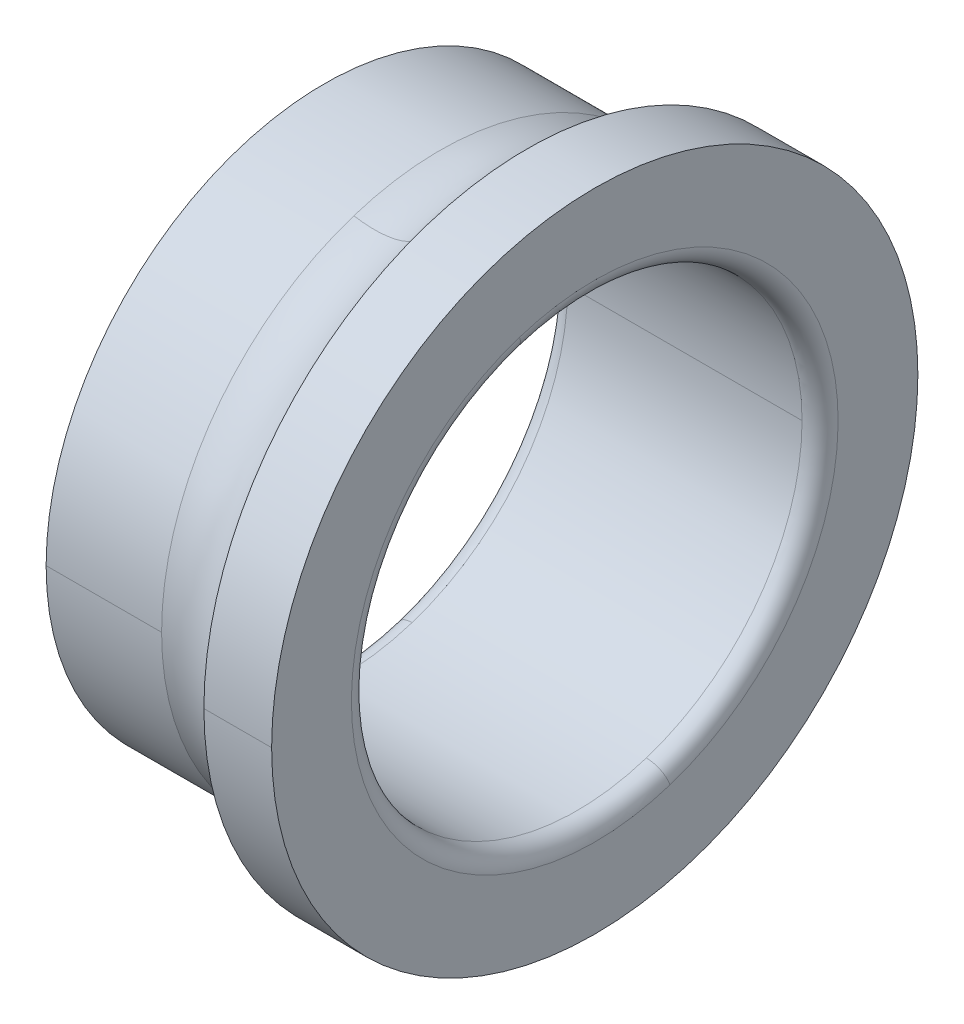
ISO-10303-21;
HEADER;
FILE_DESCRIPTION(('STEP AP214'),'2;1');
FILE_NAME('part.step','',(''),(''),'','','');
FILE_SCHEMA(('AUTOMOTIVE_DESIGN { 1 0 10303 214 1 1 1 1 }'));
ENDSEC;
DATA;
#1=APPLICATION_CONTEXT('core data for automotive mechanical design processes');
#2=APPLICATION_PROTOCOL_DEFINITION('international standard','automotive_design',2000,#1);
#3=PRODUCT_CONTEXT('',#1,'mechanical');
#4=PRODUCT('Part','Part','',(#3));
#5=PRODUCT_RELATED_PRODUCT_CATEGORY('part','',(#4));
#6=PRODUCT_DEFINITION_FORMATION('','',#4);
#7=PRODUCT_DEFINITION_CONTEXT('part definition',#1,'design');
#8=PRODUCT_DEFINITION('design','',#6,#7);
#9=PRODUCT_DEFINITION_SHAPE('','',#8);
#10=(LENGTH_UNIT() NAMED_UNIT(*) SI_UNIT(.MILLI.,.METRE.));
#11=(NAMED_UNIT(*) PLANE_ANGLE_UNIT() SI_UNIT($,.RADIAN.));
#12=(NAMED_UNIT(*) SI_UNIT($,.STERADIAN.) SOLID_ANGLE_UNIT());
#13=UNCERTAINTY_MEASURE_WITH_UNIT(LENGTH_MEASURE(1.E-05),#10,'distance_accuracy_value','');
#14=(GEOMETRIC_REPRESENTATION_CONTEXT(3) GLOBAL_UNCERTAINTY_ASSIGNED_CONTEXT((#13)) GLOBAL_UNIT_ASSIGNED_CONTEXT((#10,
#11,#12)) REPRESENTATION_CONTEXT('',''));
#15=CARTESIAN_POINT('',(0.,0.,0.));
#16=DIRECTION('',(0.,0.,1.));
#17=DIRECTION('',(1.,0.,0.));
#18=AXIS2_PLACEMENT_3D('',#15,#16,#17);
#19=CARTESIAN_POINT('',(15.,0.,0.));
#20=DIRECTION('',(1.,0.,0.));
#21=DIRECTION('',(0.,1.,0.));
#22=AXIS2_PLACEMENT_3D('',#19,#20,#21);
#23=CYLINDRICAL_SURFACE('',#22,15.435);
#24=DIRECTION('',(1.,0.,0.));
#25=VECTOR('',#24,1.);
#26=CARTESIAN_POINT('',(0.,0.,15.435));
#27=LINE('',#26,#25);
#28=CARTESIAN_POINT('',(0.,0.,15.435));
#29=VERTEX_POINT('',#28);
#30=CARTESIAN_POINT('',(6.405131971423,0.,15.435));
#31=VERTEX_POINT('',#30);
#32=EDGE_CURVE('E11',#29,#31,#27,.T.);
#33=ORIENTED_EDGE('',*,*,#32,.F.);
#34=CARTESIAN_POINT('',(0.,0.,0.));
#35=DIRECTION('',(1.,0.,0.));
#36=DIRECTION('',(0.,0.,-1.));
#37=AXIS2_PLACEMENT_3D('',#34,#35,#36);
#38=CIRCLE('',#37,15.435);
#39=CARTESIAN_POINT('',(0.,0.,-15.435));
#40=VERTEX_POINT('',#39);
#41=EDGE_CURVE('E25',#29,#40,#38,.T.);
#42=ORIENTED_EDGE('',*,*,#41,.T.);
#43=DIRECTION('',(1.,0.,0.));
#44=VECTOR('',#43,1.);
#45=CARTESIAN_POINT('',(0.,0.,-15.435));
#46=LINE('',#45,#44);
#47=CARTESIAN_POINT('',(6.405131971423,0.,-15.435));
#48=VERTEX_POINT('',#47);
#49=EDGE_CURVE('E326',#40,#48,#46,.T.);
#50=ORIENTED_EDGE('',*,*,#49,.T.);
#51=CARTESIAN_POINT('',(6.405131971423,0.,0.));
#52=DIRECTION('',(1.,0.,0.));
#53=DIRECTION('',(0.,0.,-1.));
#54=AXIS2_PLACEMENT_3D('',#51,#52,#53);
#55=CIRCLE('',#54,15.435);
#56=CARTESIAN_POINT('',(6.40513197142301,-14.6795573290157,-4.76967730817731));
#57=VERTEX_POINT('',#56);
#58=EDGE_CURVE('E321',#57,#48,#55,.T.);
#59=ORIENTED_EDGE('',*,*,#58,.F.);
#60=CARTESIAN_POINT('',(6.405131971423,0.,0.));
#61=DIRECTION('',(1.,0.,0.));
#62=DIRECTION('',(0.,0.,-1.));
#63=AXIS2_PLACEMENT_3D('',#60,#61,#62);
#64=CIRCLE('',#63,15.435);
#65=EDGE_CURVE('E316',#31,#57,#64,.T.);
#66=ORIENTED_EDGE('',*,*,#65,.F.);
#67=EDGE_LOOP('',(#33,#42,#50,#59,#66));
#68=FACE_BOUND('',#67,.T.);
#69=ADVANCED_FACE('F17',(#68),#23,.T.);
#70=CARTESIAN_POINT('',(7.50000000000026,0.,0.));
#71=DIRECTION('',(1.,0.,0.));
#72=DIRECTION('',(0.,0.309016994374947,-0.951056516295154));
#73=AXIS2_PLACEMENT_3D('',#70,#71,#72);
#74=TOROIDAL_SURFACE('',#73,19.2499999999994,3.9689999999995);
#75=CARTESIAN_POINT('',(7.50000000000026,-18.3078379386811,-5.94857714171755));
#76=DIRECTION('',(0.,0.309016994374947,-0.951056516295154));
#77=DIRECTION('',(-0.275854882483595,0.914154852523531,0.297026916991783));
#78=AXIS2_PLACEMENT_3D('',#75,#76,#77);
#79=CIRCLE('',#78,3.9689999999995);
#80=CARTESIAN_POINT('',(11.241301377863,-17.0476880545906,-5.53912962417093));
#81=VERTEX_POINT('',#80);
#82=EDGE_CURVE('E312',#57,#81,#79,.T.);
#83=ORIENTED_EDGE('',*,*,#82,.T.);
#84=CARTESIAN_POINT('',(11.241301377863,0.,0.));
#85=DIRECTION('',(1.,0.,0.));
#86=DIRECTION('',(0.,0.,-1.));
#87=AXIS2_PLACEMENT_3D('',#84,#85,#86);
#88=CIRCLE('',#87,17.925);
#89=CARTESIAN_POINT('',(11.241301377863,0.,17.925));
#90=VERTEX_POINT('',#89);
#91=EDGE_CURVE('E110',#90,#81,#88,.T.);
#92=ORIENTED_EDGE('',*,*,#91,.F.);
#93=CARTESIAN_POINT('',(11.241301377863,0.,0.));
#94=DIRECTION('',(1.,0.,0.));
#95=DIRECTION('',(0.,0.,-1.));
#96=AXIS2_PLACEMENT_3D('',#93,#94,#95);
#97=CIRCLE('',#96,17.925);
#98=CARTESIAN_POINT('',(11.241301377863,17.0476880545906,5.53912962417093));
#99=VERTEX_POINT('',#98);
#100=EDGE_CURVE('E305',#99,#90,#97,.T.);
#101=ORIENTED_EDGE('',*,*,#100,.F.);
#102=CARTESIAN_POINT('',(7.50000000000026,18.3078379386811,5.94857714171755));
#103=DIRECTION('',(0.,-0.309016994374947,0.951056516295154));
#104=DIRECTION('',(-0.275854882483596,-0.914154852523531,-0.297026916991783));
#105=AXIS2_PLACEMENT_3D('',#102,#103,#104);
#106=CIRCLE('',#105,3.9689999999995);
#107=CARTESIAN_POINT('',(6.40513197142301,14.6795573290157,4.76967730817731));
#108=VERTEX_POINT('',#107);
#109=EDGE_CURVE('E120',#108,#99,#106,.T.);
#110=ORIENTED_EDGE('',*,*,#109,.F.);
#111=CARTESIAN_POINT('',(6.405131971423,0.,0.));
#112=DIRECTION('',(1.,0.,0.));
#113=DIRECTION('',(0.,0.,-1.));
#114=AXIS2_PLACEMENT_3D('',#111,#112,#113);
#115=CIRCLE('',#114,15.435);
#116=EDGE_CURVE('E297',#108,#31,#115,.T.);
#117=ORIENTED_EDGE('',*,*,#116,.T.);
#118=ORIENTED_EDGE('',*,*,#65,.T.);
#119=EDGE_LOOP('',(#83,#92,#101,#110,#117,#118));
#120=FACE_BOUND('',#119,.T.);
#121=ADVANCED_FACE('F339',(#120),#74,.F.);
#122=CARTESIAN_POINT('',(15.,0.,0.));
#123=DIRECTION('',(1.,0.,0.));
#124=DIRECTION('',(0.,-1.,0.));
#125=AXIS2_PLACEMENT_3D('',#122,#123,#124);
#126=CYLINDRICAL_SURFACE('',#125,15.435);
#127=ORIENTED_EDGE('',*,*,#32,.T.);
#128=ORIENTED_EDGE('',*,*,#116,.F.);
#129=CARTESIAN_POINT('',(6.405131971423,0.,0.));
#130=DIRECTION('',(1.,0.,0.));
#131=DIRECTION('',(0.,0.,-1.));
#132=AXIS2_PLACEMENT_3D('',#129,#130,#131);
#133=CIRCLE('',#132,15.435);
#134=EDGE_CURVE('E293',#48,#108,#133,.T.);
#135=ORIENTED_EDGE('',*,*,#134,.F.);
#136=ORIENTED_EDGE('',*,*,#49,.F.);
#137=CARTESIAN_POINT('',(0.,0.,0.));
#138=DIRECTION('',(1.,0.,0.));
#139=DIRECTION('',(0.,0.,-1.));
#140=AXIS2_PLACEMENT_3D('',#137,#138,#139);
#141=CIRCLE('',#140,15.435);
#142=EDGE_CURVE('E289',#40,#29,#141,.T.);
#143=ORIENTED_EDGE('',*,*,#142,.T.);
#144=EDGE_LOOP('',(#127,#128,#135,#136,#143));
#145=FACE_BOUND('',#144,.T.);
#146=ADVANCED_FACE('F270',(#145),#126,.T.);
#147=CARTESIAN_POINT('',(0.,15.435,0.));
#148=DIRECTION('',(-1.,0.,0.));
#149=DIRECTION('',(0.,0.,1.));
#150=AXIS2_PLACEMENT_3D('',#147,#148,#149);
#151=PLANE('',#150);
#152=CARTESIAN_POINT('',(0.,0.,0.));
#153=DIRECTION('',(1.,0.,0.));
#154=DIRECTION('',(0.,0.,-1.));
#155=AXIS2_PLACEMENT_3D('',#152,#153,#154);
#156=CIRCLE('',#155,13.5);
#157=CARTESIAN_POINT('',(0.,12.8392629699838,4.17172942406155));
#158=VERTEX_POINT('',#157);
#159=CARTESIAN_POINT('',(0.,-12.8392629699838,-4.17172942406155));
#160=VERTEX_POINT('',#159);
#161=EDGE_CURVE('E287',#158,#160,#156,.T.);
#162=ORIENTED_EDGE('',*,*,#161,.T.);
#163=CARTESIAN_POINT('',(0.,-12.8392629699846,-4.17172942406179));
#164=CARTESIAN_POINT('',(0.,-12.1839426289104,-6.18849726476169));
#165=CARTESIAN_POINT('',(0.,-11.132793947267,-8.07671556446459));
#166=CARTESIAN_POINT('',(0.,-9.718783629147,-9.73221970907687));
#167=CARTESIAN_POINT('',(0.,-6.3178643906336,-12.3995022947433));
#168=CARTESIAN_POINT('',(0.,-2.16097457552139,-13.5831280076085));
#169=CARTESIAN_POINT('',(0.,0.00950126210939699,-13.7539518618789));
#170=CARTESIAN_POINT('',(0.,4.30036652574963,-13.2351672601192));
#171=CARTESIAN_POINT('',(0.,8.0766833826385,-11.132765497821));
#172=CARTESIAN_POINT('',(0.,9.73222747888206,-9.7187924088551));
#173=CARTESIAN_POINT('',(0.,12.3995042447957,-6.31786056344028));
#174=CARTESIAN_POINT('',(0.,13.5831163376985,-2.16097345019989));
#175=CARTESIAN_POINT('',(0.,13.7539937939669,0.00949194862997871));
#176=CARTESIAN_POINT('',(0.,13.4945240713571,2.15494233521602));
#177=CARTESIAN_POINT('',(0.,12.8392629699846,4.17172942406179));
#178=B_SPLINE_CURVE_WITH_KNOTS('',5,(#163,#164,#165,#166,#167,#168,#169,#170,#171,#172,#173,
#174,#175,#176,#177),.UNSPECIFIED.,.F.,.F.,(6,3,3,3,6),(0.,0.785398163397448,1.5707963267949,
2.35619449019234,3.14159265358979),.UNSPECIFIED.);
#179=EDGE_CURVE('E285',#160,#158,#178,.T.);
#180=ORIENTED_EDGE('',*,*,#179,.T.);
#181=EDGE_LOOP('',(#162,#180));
#182=FACE_BOUND('',#181,.T.);
#183=ORIENTED_EDGE('',*,*,#41,.F.);
#184=ORIENTED_EDGE('',*,*,#142,.F.);
#185=EDGE_LOOP('',(#183,#184));
#186=FACE_BOUND('',#185,.T.);
#187=ADVANCED_FACE('F264',(#182,#186),#151,.T.);
#188=CARTESIAN_POINT('',(0.99999999999922,0.,0.));
#189=DIRECTION('',(1.,0.,0.));
#190=DIRECTION('',(0.,-0.309016994374947,0.951056516295154));
#191=AXIS2_PLACEMENT_3D('',#188,#189,#190);
#192=TOROIDAL_SURFACE('',#191,13.4999999999992,0.99999999999922);
#193=CARTESIAN_POINT('',(0.99999999999922,-12.8392629699838,-4.17172942406155));
#194=DIRECTION('',(0.,0.309016994374947,-0.951056516295154));
#195=DIRECTION('',(-1.,0.,0.));
#196=AXIS2_PLACEMENT_3D('',#193,#194,#195);
#197=CIRCLE('',#196,0.99999999999922);
#198=CARTESIAN_POINT('',(1.,-11.8882064536894,-3.86271242968684));
#199=VERTEX_POINT('',#198);
#200=EDGE_CURVE('E494',#160,#199,#197,.T.);
#201=ORIENTED_EDGE('',*,*,#200,.T.);
#202=CARTESIAN_POINT('',(1.,0.,0.));
#203=DIRECTION('',(1.,0.,0.));
#204=DIRECTION('',(0.,0.,-1.));
#205=AXIS2_PLACEMENT_3D('',#202,#203,#204);
#206=CIRCLE('',#205,12.5);
#207=CARTESIAN_POINT('',(1.,0.,-12.5));
#208=VERTEX_POINT('',#207);
#209=EDGE_CURVE('E492',#199,#208,#206,.T.);
#210=ORIENTED_EDGE('',*,*,#209,.T.);
#211=CARTESIAN_POINT('',(1.,0.,0.));
#212=DIRECTION('',(1.,0.,0.));
#213=DIRECTION('',(0.,0.,-1.));
#214=AXIS2_PLACEMENT_3D('',#211,#212,#213);
#215=CIRCLE('',#214,12.5);
#216=CARTESIAN_POINT('',(1.,11.8882064536894,3.86271242968684));
#217=VERTEX_POINT('',#216);
#218=EDGE_CURVE('E490',#208,#217,#215,.T.);
#219=ORIENTED_EDGE('',*,*,#218,.T.);
#220=CARTESIAN_POINT('',(0.99999999999922,12.8392629699838,4.17172942406155));
#221=DIRECTION('',(0.,-0.309016994374947,0.951056516295154));
#222=DIRECTION('',(-1.,0.,0.));
#223=AXIS2_PLACEMENT_3D('',#220,#221,#222);
#224=CIRCLE('',#223,0.99999999999922);
#225=EDGE_CURVE('E244',#158,#217,#224,.T.);
#226=ORIENTED_EDGE('',*,*,#225,.F.);
#227=ORIENTED_EDGE('',*,*,#179,.F.);
#228=EDGE_LOOP('',(#201,#210,#219,#226,#227));
#229=FACE_BOUND('',#228,.T.);
#230=ADVANCED_FACE('F253',(#229),#192,.T.);
#231=CARTESIAN_POINT('',(0.99999999999922,0.,0.));
#232=DIRECTION('',(1.,0.,0.));
#233=DIRECTION('',(0.,0.309016994374947,-0.951056516295154));
#234=AXIS2_PLACEMENT_3D('',#231,#232,#233);
#235=TOROIDAL_SURFACE('',#234,13.4999999999992,0.99999999999922);
#236=ORIENTED_EDGE('',*,*,#200,.F.);
#237=ORIENTED_EDGE('',*,*,#161,.F.);
#238=ORIENTED_EDGE('',*,*,#225,.T.);
#239=CARTESIAN_POINT('',(1.,0.,0.));
#240=DIRECTION('',(1.,0.,0.));
#241=DIRECTION('',(0.,0.,-1.));
#242=AXIS2_PLACEMENT_3D('',#239,#240,#241);
#243=CIRCLE('',#242,12.5);
#244=CARTESIAN_POINT('',(1.,0.,12.5));
#245=VERTEX_POINT('',#244);
#246=EDGE_CURVE('E240',#217,#245,#243,.T.);
#247=ORIENTED_EDGE('',*,*,#246,.T.);
#248=CARTESIAN_POINT('',(1.,0.,0.));
#249=DIRECTION('',(1.,0.,0.));
#250=DIRECTION('',(0.,0.,-1.));
#251=AXIS2_PLACEMENT_3D('',#248,#249,#250);
#252=CIRCLE('',#251,12.5);
#253=EDGE_CURVE('E235',#245,#199,#252,.T.);
#254=ORIENTED_EDGE('',*,*,#253,.T.);
#255=EDGE_LOOP('',(#236,#237,#238,#247,#254));
#256=FACE_BOUND('',#255,.T.);
#257=ADVANCED_FACE('F263',(#256),#235,.T.);
#258=CARTESIAN_POINT('',(15.,0.,0.));
#259=DIRECTION('',(1.,0.,0.));
#260=DIRECTION('',(0.,1.,0.));
#261=AXIS2_PLACEMENT_3D('',#258,#259,#260);
#262=CYLINDRICAL_SURFACE('',#261,12.5);
#263=DIRECTION('',(1.,0.,0.));
#264=VECTOR('',#263,1.);
#265=CARTESIAN_POINT('',(1.,0.,12.5));
#266=LINE('',#265,#264);
#267=CARTESIAN_POINT('',(14.,0.,12.5));
#268=VERTEX_POINT('',#267);
#269=EDGE_CURVE('E231',#245,#268,#266,.T.);
#270=ORIENTED_EDGE('',*,*,#269,.T.);
#271=CARTESIAN_POINT('',(14.,0.,0.));
#272=DIRECTION('',(1.,0.,0.));
#273=DIRECTION('',(0.,0.,-1.));
#274=AXIS2_PLACEMENT_3D('',#271,#272,#273);
#275=CIRCLE('',#274,12.5);
#276=CARTESIAN_POINT('',(14.,-11.8882064536894,-3.86271242968684));
#277=VERTEX_POINT('',#276);
#278=EDGE_CURVE('E227',#268,#277,#275,.T.);
#279=ORIENTED_EDGE('',*,*,#278,.T.);
#280=CARTESIAN_POINT('',(14.,0.,0.));
#281=DIRECTION('',(1.,0.,0.));
#282=DIRECTION('',(0.,0.,-1.));
#283=AXIS2_PLACEMENT_3D('',#280,#281,#282);
#284=CIRCLE('',#283,12.5);
#285=CARTESIAN_POINT('',(14.,0.,-12.5));
#286=VERTEX_POINT('',#285);
#287=EDGE_CURVE('E223',#277,#286,#284,.T.);
#288=ORIENTED_EDGE('',*,*,#287,.T.);
#289=DIRECTION('',(1.,0.,0.));
#290=VECTOR('',#289,1.);
#291=CARTESIAN_POINT('',(1.,0.,-12.5));
#292=LINE('',#291,#290);
#293=EDGE_CURVE('E218',#208,#286,#292,.T.);
#294=ORIENTED_EDGE('',*,*,#293,.F.);
#295=ORIENTED_EDGE('',*,*,#209,.F.);
#296=ORIENTED_EDGE('',*,*,#253,.F.);
#297=EDGE_LOOP('',(#270,#279,#288,#294,#295,#296));
#298=FACE_BOUND('',#297,.T.);
#299=ADVANCED_FACE('F390',(#298),#262,.F.);
#300=CARTESIAN_POINT('',(15.,0.,0.));
#301=DIRECTION('',(1.,0.,0.));
#302=DIRECTION('',(0.,-1.,0.));
#303=AXIS2_PLACEMENT_3D('',#300,#301,#302);
#304=CYLINDRICAL_SURFACE('',#303,12.5);
#305=ORIENTED_EDGE('',*,*,#269,.F.);
#306=ORIENTED_EDGE('',*,*,#246,.F.);
#307=ORIENTED_EDGE('',*,*,#218,.F.);
#308=ORIENTED_EDGE('',*,*,#293,.T.);
#309=CARTESIAN_POINT('',(14.,0.,0.));
#310=DIRECTION('',(1.,0.,0.));
#311=DIRECTION('',(0.,0.,-1.));
#312=AXIS2_PLACEMENT_3D('',#309,#310,#311);
#313=CIRCLE('',#312,12.5);
#314=CARTESIAN_POINT('',(14.,11.8882064536894,3.86271242968684));
#315=VERTEX_POINT('',#314);
#316=EDGE_CURVE('E214',#286,#315,#313,.T.);
#317=ORIENTED_EDGE('',*,*,#316,.T.);
#318=CARTESIAN_POINT('',(14.,0.,0.));
#319=DIRECTION('',(1.,0.,0.));
#320=DIRECTION('',(0.,0.,-1.));
#321=AXIS2_PLACEMENT_3D('',#318,#319,#320);
#322=CIRCLE('',#321,12.5);
#323=EDGE_CURVE('E209',#315,#268,#322,.T.);
#324=ORIENTED_EDGE('',*,*,#323,.T.);
#325=EDGE_LOOP('',(#305,#306,#307,#308,#317,#324));
#326=FACE_BOUND('',#325,.T.);
#327=ADVANCED_FACE('F400',(#326),#304,.F.);
#328=CARTESIAN_POINT('',(14.0000000000015,0.,0.));
#329=DIRECTION('',(1.,0.,0.));
#330=DIRECTION('',(0.,0.309016994374947,-0.951056516295154));
#331=AXIS2_PLACEMENT_3D('',#328,#329,#330);
#332=TOROIDAL_SURFACE('',#331,13.4999999999984,0.99999999999845);
#333=CARTESIAN_POINT('',(14.0000000000015,-12.8392629699831,-4.17172942406131));
#334=DIRECTION('',(0.,0.309016994374947,-0.951056516295154));
#335=DIRECTION('',(-1.538325022923E-12,0.951056516295154,0.309016994374947));
#336=AXIS2_PLACEMENT_3D('',#333,#334,#335);
#337=CIRCLE('',#336,0.999999999998449);
#338=CARTESIAN_POINT('',(15.,-12.8392629699831,-4.17172942406131));
#339=VERTEX_POINT('',#338);
#340=EDGE_CURVE('E188',#277,#339,#337,.T.);
#341=ORIENTED_EDGE('',*,*,#340,.F.);
#342=ORIENTED_EDGE('',*,*,#278,.F.);
#343=ORIENTED_EDGE('',*,*,#323,.F.);
#344=CARTESIAN_POINT('',(14.0000000000015,12.8392629699831,4.17172942406131));
#345=DIRECTION('',(0.,-0.309016994374947,0.951056516295154));
#346=DIRECTION('',(-1.538325022923E-12,-0.951056516295154,-0.309016994374947));
#347=AXIS2_PLACEMENT_3D('',#344,#345,#346);
#348=CIRCLE('',#347,0.99999999999845);
#349=CARTESIAN_POINT('',(15.,12.8392629699831,4.17172942406131));
#350=VERTEX_POINT('',#349);
#351=EDGE_CURVE('E187',#315,#350,#348,.T.);
#352=ORIENTED_EDGE('',*,*,#351,.T.);
#353=CARTESIAN_POINT('',(15.,12.8392629699831,4.17172942406133));
#354=CARTESIAN_POINT('',(15.,12.7710075943356,4.38181303325399));
#355=CARTESIAN_POINT('',(15.,12.6975874010329,4.59021807223762));
#356=CARTESIAN_POINT('',(15.,12.5406135083281,5.00317626233255));
#357=CARTESIAN_POINT('',(15.,12.457059808926,5.20772941344384));
#358=CARTESIAN_POINT('',(15.,12.2800150332338,5.61248908033976));
#359=CARTESIAN_POINT('',(15.,12.1865239569436,5.81269559612439));
#360=CARTESIAN_POINT('',(15.,11.9898310380084,6.2082802027819));
#361=CARTESIAN_POINT('',(15.,11.8866291953634,6.40365829365477));
#362=CARTESIAN_POINT('',(15.,11.6707629955994,6.78911522676152));
#363=CARTESIAN_POINT('',(15.,11.5580986384805,6.97919406899541));
#364=CARTESIAN_POINT('',(15.,11.3235789273211,7.35359462596973));
#365=CARTESIAN_POINT('',(15.,11.2017235732806,7.53791634071017));
#366=CARTESIAN_POINT('',(15.,10.9491154019057,7.90035858543361));
#367=CARTESIAN_POINT('',(15.,10.8183625845713,8.07847911541663));
#368=CARTESIAN_POINT('',(15.,10.548274488724,8.42808988537554));
#369=CARTESIAN_POINT('',(15.,10.408939210211,8.59958012535145));
#370=CARTESIAN_POINT('',(15.,10.1220218609874,8.93551717956152));
#371=CARTESIAN_POINT('',(15.,9.97443979027678,9.09996399379568));
#372=CARTESIAN_POINT('',(15.,9.67138439530445,9.42141802993741));
#373=CARTESIAN_POINT('',(15.,9.51591107104275,9.57842525184497));
#374=CARTESIAN_POINT('',(15.,9.19744771768723,9.88462185913161));
#375=CARTESIAN_POINT('',(15.,9.03445768859339,10.0338112445107));
#376=CARTESIAN_POINT('',(15.,8.70135358286664,10.3240127684575));
#377=CARTESIAN_POINT('',(15.,8.53123950623373,10.4650249070252));
#378=CARTESIAN_POINT('',(15.,8.18429712512982,10.7385322267525));
#379=CARTESIAN_POINT('',(15.,8.00746882065883,10.8710274079121));
#380=CARTESIAN_POINT('',(15.,7.6475239787552,11.1271816203276));
#381=CARTESIAN_POINT('',(15.,7.46440744132256,11.2508406515835));
#382=CARTESIAN_POINT('',(15.,7.09232727727273,11.4890246587537));
#383=CARTESIAN_POINT('',(15.,6.90336365065554,11.603549634668));
#384=CARTESIAN_POINT('',(15.,6.52004453816456,11.823189630457));
#385=CARTESIAN_POINT('',(15.,6.32568905229077,11.9283046503317));
#386=CARTESIAN_POINT('',(15.,5.93205444067555,12.1288715027515));
#387=CARTESIAN_POINT('',(15.,5.73277531493413,12.2243233352966));
#388=CARTESIAN_POINT('',(15.,5.32977350445234,12.4053338612322));
#389=CARTESIAN_POINT('',(15.,5.12605081971199,12.4908925546226));
#390=CARTESIAN_POINT('',(15.,4.71465267702389,12.6519106838622));
#391=CARTESIAN_POINT('',(15.,4.50697721907614,12.7273701197115));
#392=CARTESIAN_POINT('',(15.,4.08817383834168,12.8680079454784));
#393=CARTESIAN_POINT('',(15.,3.87704591555496,12.933186335396));
#394=CARTESIAN_POINT('',(15.,3.45184623080117,13.0531050488495));
#395=CARTESIAN_POINT('',(15.,3.2377744688341,13.1078453723853));
#396=CARTESIAN_POINT('',(15.,2.80720282334464,13.2067560788409));
#397=CARTESIAN_POINT('',(15.,2.59070293982225,13.2509264617608));
#398=CARTESIAN_POINT('',(15.,2.15579661840474,13.3285908766632));
#399=CARTESIAN_POINT('',(15.,1.9373901805096,13.3620849086458));
#400=CARTESIAN_POINT('',(15.,1.49919691058562,13.418315931617));
#401=CARTESIAN_POINT('',(15.,1.27941007855677,13.4410529226055));
#402=CARTESIAN_POINT('',(15.,0.838985506094766,13.4757150881858));
#403=CARTESIAN_POINT('',(15.,0.618347765661609,13.4876402627775));
#404=CARTESIAN_POINT('',(15.,0.176752912033277,13.5006500667739));
#405=CARTESIAN_POINT('',(15.,-0.0442042011618989,13.5017346961787));
#406=CARTESIAN_POINT('',(15.,-0.485905495275026,13.4930607968339));
#407=CARTESIAN_POINT('',(15.,-0.706649676192978,13.4833022680845));
#408=CARTESIAN_POINT('',(15.,-1.14739331368492,13.4529655615818));
#409=CARTESIAN_POINT('',(15.,-1.36739277025891,13.4323873838287));
#410=CARTESIAN_POINT('',(15.,-1.80611696110236,13.3804609539512));
#411=CARTESIAN_POINT('',(15.,-2.02484169537182,13.349112701827));
#412=CARTESIAN_POINT('',(15.,-2.46048951456334,13.2757216438926));
#413=CARTESIAN_POINT('',(15.,-2.6774125994854,13.2336788380825));
#414=CARTESIAN_POINT('',(15.,-3.10893453327032,13.138999957578));
#415=CARTESIAN_POINT('',(15.,-3.32353338213318,13.0863638828837));
#416=CARTESIAN_POINT('',(15.,-3.74988985637614,12.9706252695251));
#417=CARTESIAN_POINT('',(15.,-3.96164748175624,12.9075227308609));
#418=CARTESIAN_POINT('',(15.,-4.38181136636639,12.7710032091053));
#419=CARTESIAN_POINT('',(15.,-4.59021762559642,12.697586226014));
#420=CARTESIAN_POINT('',(15.,-5.00317670897371,12.540614683347));
#421=CARTESIAN_POINT('',(15.,-5.20772953312097,12.4570601237714));
#422=CARTESIAN_POINT('',(15.,-5.6124889606626,12.2800147183884));
#423=CARTESIAN_POINT('',(15.,-5.81269556405698,12.1865238725811));
#424=CARTESIAN_POINT('',(15.,-6.20828023484927,11.989831122371));
#425=CARTESIAN_POINT('',(15.,-6.40365830224719,11.8866292179682));
#426=CARTESIAN_POINT('',(15.,-6.78911521816907,11.6707629729946));
#427=CARTESIAN_POINT('',(15.,-6.97919406669305,11.5580986324236));
#428=CARTESIAN_POINT('',(15.,-7.35359462827204,11.3235789333781));
#429=CARTESIAN_POINT('',(15.,-7.53791634132706,11.2017235749036));
#430=CARTESIAN_POINT('',(15.,-7.90035858481669,10.9491154002827));
#431=CARTESIAN_POINT('',(15.,-8.07847911525132,10.8183625841365));
#432=CARTESIAN_POINT('',(15.,-8.42808988554083,10.5482744891589));
#433=CARTESIAN_POINT('',(15.,-8.59958012539572,10.4089392103276));
#434=CARTESIAN_POINT('',(15.,-8.93551717951721,10.1220218608709));
#435=CARTESIAN_POINT('',(15.,-9.0999639937838,9.97443979024557));
#436=CARTESIAN_POINT('',(15.,-9.42141802994927,9.67138439533568));
#437=CARTESIAN_POINT('',(15.,-9.57842525184814,9.51591107105113));
#438=CARTESIAN_POINT('',(15.,-9.88462185912842,9.19744771767887));
#439=CARTESIAN_POINT('',(15.,-10.0338112445098,9.03445768859117));
#440=CARTESIAN_POINT('',(15.,-10.3240127684583,8.70135358286891));
#441=CARTESIAN_POINT('',(15.,-10.4650249070254,8.53123950623435));
#442=CARTESIAN_POINT('',(15.,-10.7385322267523,8.18429712512925));
#443=CARTESIAN_POINT('',(15.,-10.871027407912,8.00746882065869));
#444=CARTESIAN_POINT('',(15.,-11.1271816203276,7.64752397875538));
#445=CARTESIAN_POINT('',(15.,-11.2508406515835,7.46440744132263));
#446=CARTESIAN_POINT('',(15.,-11.4890246587536,7.09232727727271));
#447=CARTESIAN_POINT('',(15.,-11.603549634668,6.90336365065554));
#448=CARTESIAN_POINT('',(15.,-11.823189630457,6.52004453816458));
#449=CARTESIAN_POINT('',(15.,-11.9283046503317,6.32568905229078));
#450=CARTESIAN_POINT('',(15.,-12.1288715027515,5.93205444067556));
#451=CARTESIAN_POINT('',(15.,-12.2243233352966,5.73277531493414));
#452=CARTESIAN_POINT('',(15.,-12.4053338612322,5.32977350445236));
#453=CARTESIAN_POINT('',(15.,-12.4908925546226,5.126050819712));
#454=CARTESIAN_POINT('',(15.,-12.6519106838622,4.71465267702392));
#455=CARTESIAN_POINT('',(15.,-12.7273701197113,4.50697721907621));
#456=CARTESIAN_POINT('',(15.,-12.8680079454785,4.08817383834166));
#457=CARTESIAN_POINT('',(15.,-12.9331863353966,3.87704591555481));
#458=CARTESIAN_POINT('',(15.,-13.0531050488488,3.45184623080135));
#459=CARTESIAN_POINT('',(15.,-13.1078453723829,3.23777446883474));
#460=CARTESIAN_POINT('',(15.,-13.2067560788432,2.80720282334403));
#461=CARTESIAN_POINT('',(15.,-13.2509264617694,2.59070293981993));
#462=CARTESIAN_POINT('',(15.,-13.3285908766546,2.1557966184071));
#463=CARTESIAN_POINT('',(15.,-13.3620849086136,1.93739018051838));
#464=CARTESIAN_POINT('',(15.,-13.4183159316492,1.49919691057689));
#465=CARTESIAN_POINT('',(15.,-13.4410529227258,1.27941007852414));
#466=CARTESIAN_POINT('',(15.,-13.4757150880655,0.838985506127448));
#467=CARTESIAN_POINT('',(15.,-13.4876402623285,0.618347765783513));
#468=CARTESIAN_POINT('',(15.,-13.5006500672229,0.176752911911422));
#469=CARTESIAN_POINT('',(15.,-13.5017346978543,-0.0442042016167351));
#470=CARTESIAN_POINT('',(15.,-13.4930607951583,-0.485905494820141));
#471=CARTESIAN_POINT('',(15.,-13.483302261831,-0.70664967449539));
#472=CARTESIAN_POINT('',(15.,-13.4529655678353,-1.14739331538246));
#473=CARTESIAN_POINT('',(15.,-13.4323874071669,-1.36739277659428));
#474=CARTESIAN_POINT('',(15.,-13.380460930613,-1.80611695476695));
#475=CARTESIAN_POINT('',(15.,-13.3491126147275,-2.0248416717278));
#476=CARTESIAN_POINT('',(15.,-13.2757217309921,-2.46048953820733));
#477=CARTESIAN_POINT('',(15.,-13.2336791631422,-2.67741268772601));
#478=CARTESIAN_POINT('',(15.,-13.1389996325183,-3.10893444502967));
#479=CARTESIAN_POINT('',(15.,-13.0863626697443,-3.32353305281467));
#480=CARTESIAN_POINT('',(15.,-12.9706264826645,-3.7498901856946));
#481=CARTESIAN_POINT('',(15.,-12.9075272583587,-3.96164871078955));
#482=CARTESIAN_POINT('',(15.,-12.8392629699831,-4.17172942406129));
#483=B_SPLINE_CURVE_WITH_KNOTS('',3,(#353,#354,#355,#356,#357,#358,#359,#360,#361,#362,#363,
#364,#365,#366,#367,#368,#369,#370,#371,#372,#373,#374,#375,#376,#377,#378,#379,#380,#381,#382,
#383,#384,#385,#386,#387,#388,#389,#390,#391,#392,#393,#394,#395,#396,#397,#398,#399,#400,#401,
#402,#403,#404,#405,#406,#407,#408,#409,#410,#411,#412,#413,#414,#415,#416,#417,#418,#419,#420,
#421,#422,#423,#424,#425,#426,#427,#428,#429,#430,#431,#432,#433,#434,#435,#436,#437,#438,#439,
#440,#441,#442,#443,#444,#445,#446,#447,#448,#449,#450,#451,#452,#453,#454,#455,#456,#457,#458,
#459,#460,#461,#462,#463,#464,#465,#466,#467,#468,#469,#470,#471,#472,#473,#474,#475,#476,#477,
#478,#479,#480,#481,#482),.UNSPECIFIED.,.F.,.F.,(4,2,2,2,2,2,2,2,2,2,2,2,2,2,2,2,2,2,2,2,2,2,2,
2,2,2,2,2,2,2,2,2,2,2,2,2,2,2,2,2,2,2,2,2,2,2,2,2,2,2,2,2,2,2,2,2,2,2,2,2,2,2,2,2,4),(0.,
0.662613170118552,1.32522634023711,1.98783951035566,2.65045268047422,3.31306585059277,
3.97567902071133,4.63829219082988,5.30090536094844,5.96351853106699,6.62613170118554,
7.2887448713041,7.95135804142266,8.61397121154121,9.27658438165976,9.93919755177832,
10.6018107218969,11.2644238920154,11.927037062134,12.5896502322525,13.2522634023711,
13.9148765724896,14.5774897426082,15.2401029127268,15.9027160828453,16.5653292529639,
17.2279424230824,17.890555593201,18.5531687633195,19.2157819334381,19.8783951035566,
20.5410082736752,21.2036214437937,21.8662346139123,22.5288477840309,23.1914609541494,
23.854074124268,24.5166872943865,25.1793004645051,25.8419136346236,26.5045268047422,
27.1671399748607,27.8297531449793,28.4923663150978,29.1549794852164,29.817592655335,
30.4802058254535,31.1428189955721,31.8054321656906,32.4680453358092,33.1306585059277,
33.7932716760463,34.4558848461648,35.1184980162834,35.7811111864019,36.4437243565205,
37.106337526639,37.7689506967576,38.4315638668761,39.0941770369947,39.7567902071133,
40.4194033772318,41.0820165473504,41.7446297174689,42.4072428875875),.UNSPECIFIED.);
#484=EDGE_CURVE('E182',#350,#339,#483,.T.);
#485=ORIENTED_EDGE('',*,*,#484,.T.);
#486=EDGE_LOOP('',(#341,#342,#343,#352,#485));
#487=FACE_BOUND('',#486,.T.);
#488=ADVANCED_FACE('F162',(#487),#332,.T.);
#489=CARTESIAN_POINT('',(15.,13.5,0.));
#490=DIRECTION('',(1.,0.,0.));
#491=DIRECTION('',(0.,0.,-1.));
#492=AXIS2_PLACEMENT_3D('',#489,#490,#491);
#493=PLANE('',#492);
#494=CARTESIAN_POINT('',(15.,0.,0.));
#495=DIRECTION('',(1.,0.,0.));
#496=DIRECTION('',(0.,0.,-1.));
#497=AXIS2_PLACEMENT_3D('',#494,#495,#496);
#498=CIRCLE('',#497,17.925);
#499=CARTESIAN_POINT('',(15.,0.,-17.925));
#500=VERTEX_POINT('',#499);
#501=CARTESIAN_POINT('',(15.,0.,17.925));
#502=VERTEX_POINT('',#501);
#503=EDGE_CURVE('E127',#500,#502,#498,.T.);
#504=ORIENTED_EDGE('',*,*,#503,.T.);
#505=CARTESIAN_POINT('',(15.,0.,0.));
#506=DIRECTION('',(1.,0.,0.));
#507=DIRECTION('',(0.,0.,-1.));
#508=AXIS2_PLACEMENT_3D('',#505,#506,#507);
#509=CIRCLE('',#508,17.925);
#510=EDGE_CURVE('E190',#502,#500,#509,.T.);
#511=ORIENTED_EDGE('',*,*,#510,.T.);
#512=EDGE_LOOP('',(#504,#511));
#513=FACE_BOUND('',#512,.T.);
#514=CARTESIAN_POINT('',(15.,-12.8392629699831,-4.17172942406133));
#515=CARTESIAN_POINT('',(15.,-12.7710075943356,-4.38181303325398));
#516=CARTESIAN_POINT('',(15.,-12.6975874010329,-4.59021807223762));
#517=CARTESIAN_POINT('',(15.,-12.5406135083281,-5.00317626233254));
#518=CARTESIAN_POINT('',(15.,-12.457059808926,-5.20772941344384));
#519=CARTESIAN_POINT('',(15.,-12.2800150332338,-5.61248908033976));
#520=CARTESIAN_POINT('',(15.,-12.1865239569436,-5.81269559612439));
#521=CARTESIAN_POINT('',(15.,-11.9898310380084,-6.2082802027819));
#522=CARTESIAN_POINT('',(15.,-11.8866291953634,-6.40365829365477));
#523=CARTESIAN_POINT('',(15.,-11.6707629955994,-6.78911522676152));
#524=CARTESIAN_POINT('',(15.,-11.5580986384805,-6.9791940689954));
#525=CARTESIAN_POINT('',(15.,-11.3235789273211,-7.35359462596972));
#526=CARTESIAN_POINT('',(15.,-11.2017235732806,-7.53791634071016));
#527=CARTESIAN_POINT('',(15.,-10.9491154019057,-7.90035858543361));
#528=CARTESIAN_POINT('',(15.,-10.8183625845713,-8.07847911541662));
#529=CARTESIAN_POINT('',(15.,-10.548274488724,-8.42808988537554));
#530=CARTESIAN_POINT('',(15.,-10.408939210211,-8.59958012535144));
#531=CARTESIAN_POINT('',(15.,-10.1220218609874,-8.93551717956151));
#532=CARTESIAN_POINT('',(15.,-9.97443979027678,-9.09996399379568));
#533=CARTESIAN_POINT('',(15.,-9.67138439530445,-9.4214180299374));
#534=CARTESIAN_POINT('',(15.,-9.51591107104276,-9.57842525184497));
#535=CARTESIAN_POINT('',(15.,-9.19744771768723,-9.8846218591316));
#536=CARTESIAN_POINT('',(15.,-9.0344576885934,-10.0338112445107));
#537=CARTESIAN_POINT('',(15.,-8.70135358286665,-10.3240127684575));
#538=CARTESIAN_POINT('',(15.,-8.53123950623374,-10.4650249070252));
#539=CARTESIAN_POINT('',(15.,-8.18429712512983,-10.7385322267525));
#540=CARTESIAN_POINT('',(15.,-8.00746882065884,-10.8710274079121));
#541=CARTESIAN_POINT('',(15.,-7.64752397875521,-11.1271816203276));
#542=CARTESIAN_POINT('',(15.,-7.46440744132257,-11.2508406515835));
#543=CARTESIAN_POINT('',(15.,-7.09232727727274,-11.4890246587537));
#544=CARTESIAN_POINT('',(15.,-6.90336365065554,-11.603549634668));
#545=CARTESIAN_POINT('',(15.,-6.52004453816456,-11.823189630457));
#546=CARTESIAN_POINT('',(15.,-6.32568905229077,-11.9283046503317));
#547=CARTESIAN_POINT('',(15.,-5.93205444067556,-12.1288715027515));
#548=CARTESIAN_POINT('',(15.,-5.73277531493413,-12.2243233352966));
#549=CARTESIAN_POINT('',(15.,-5.32977350445235,-12.4053338612322));
#550=CARTESIAN_POINT('',(15.,-5.126050819712,-12.4908925546226));
#551=CARTESIAN_POINT('',(15.,-4.7146526770239,-12.6519106838622));
#552=CARTESIAN_POINT('',(15.,-4.50697721907615,-12.7273701197115));
#553=CARTESIAN_POINT('',(15.,-4.08817383834169,-12.8680079454784));
#554=CARTESIAN_POINT('',(15.,-3.87704591555498,-12.933186335396));
#555=CARTESIAN_POINT('',(15.,-3.45184623080118,-13.0531050488495));
#556=CARTESIAN_POINT('',(15.,-3.23777446883411,-13.1078453723853));
#557=CARTESIAN_POINT('',(15.,-2.80720282334465,-13.2067560788409));
#558=CARTESIAN_POINT('',(15.,-2.59070293982227,-13.2509264617608));
#559=CARTESIAN_POINT('',(15.,-2.15579661840476,-13.3285908766632));
#560=CARTESIAN_POINT('',(15.,-1.93739018050963,-13.3620849086458));
#561=CARTESIAN_POINT('',(15.,-1.49919691058564,-13.418315931617));
#562=CARTESIAN_POINT('',(15.,-1.27941007855679,-13.4410529226055));
#563=CARTESIAN_POINT('',(15.,-0.838985506094784,-13.4757150881858));
#564=CARTESIAN_POINT('',(15.,-0.618347765661625,-13.4876402627775));
#565=CARTESIAN_POINT('',(15.,-0.176752912033292,-13.5006500667739));
#566=CARTESIAN_POINT('',(15.,0.0442042011618822,-13.5017346961787));
#567=CARTESIAN_POINT('',(15.,0.485905495275009,-13.4930607968339));
#568=CARTESIAN_POINT('',(15.,0.706649676192963,-13.4833022680845));
#569=CARTESIAN_POINT('',(15.,1.1473933136849,-13.4529655615818));
#570=CARTESIAN_POINT('',(15.,1.36739277025889,-13.4323873838287));
#571=CARTESIAN_POINT('',(15.,1.80611696110234,-13.3804609539513));
#572=CARTESIAN_POINT('',(15.,2.0248416953718,-13.349112701827));
#573=CARTESIAN_POINT('',(15.,2.46048951456332,-13.2757216438926));
#574=CARTESIAN_POINT('',(15.,2.67741259948538,-13.2336788380825));
#575=CARTESIAN_POINT('',(15.,3.1089345332703,-13.138999957578));
#576=CARTESIAN_POINT('',(15.,3.32353338213315,-13.0863638828837));
#577=CARTESIAN_POINT('',(15.,3.74988985637612,-12.9706252695251));
#578=CARTESIAN_POINT('',(15.,3.96164748175622,-12.9075227308609));
#579=CARTESIAN_POINT('',(15.,4.38181136636636,-12.7710032091053));
#580=CARTESIAN_POINT('',(15.,4.5902176255964,-12.697586226014));
#581=CARTESIAN_POINT('',(15.,5.00317670897369,-12.540614683347));
#582=CARTESIAN_POINT('',(15.,5.20772953312094,-12.4570601237714));
#583=CARTESIAN_POINT('',(15.,5.61248896066258,-12.2800147183884));
#584=CARTESIAN_POINT('',(15.,5.81269556405696,-12.1865238725811));
#585=CARTESIAN_POINT('',(15.,6.20828023484926,-11.989831122371));
#586=CARTESIAN_POINT('',(15.,6.40365830224717,-11.8866292179683));
#587=CARTESIAN_POINT('',(15.,6.78911521816906,-11.6707629729946));
#588=CARTESIAN_POINT('',(15.,6.97919406669304,-11.5580986324236));
#589=CARTESIAN_POINT('',(15.,7.35359462827203,-11.3235789333781));
#590=CARTESIAN_POINT('',(15.,7.53791634132704,-11.2017235749036));
#591=CARTESIAN_POINT('',(15.,7.90035858481668,-10.9491154002828));
#592=CARTESIAN_POINT('',(15.,8.0784791152513,-10.8183625841365));
#593=CARTESIAN_POINT('',(15.,8.42808988554081,-10.5482744891589));
#594=CARTESIAN_POINT('',(15.,8.59958012539571,-10.4089392103276));
#595=CARTESIAN_POINT('',(15.,8.93551717951719,-10.1220218608709));
#596=CARTESIAN_POINT('',(15.,9.09996399378378,-9.97443979024558));
#597=CARTESIAN_POINT('',(15.,9.42141802994925,-9.6713843953357));
#598=CARTESIAN_POINT('',(15.,9.57842525184812,-9.51591107105115));
#599=CARTESIAN_POINT('',(15.,9.8846218591284,-9.19744771767889));
#600=CARTESIAN_POINT('',(15.,10.0338112445098,-9.03445768859119));
#601=CARTESIAN_POINT('',(15.,10.3240127684583,-8.70135358286893));
#602=CARTESIAN_POINT('',(15.,10.4650249070254,-8.53123950623437));
#603=CARTESIAN_POINT('',(15.,10.7385322267522,-8.18429712512926));
#604=CARTESIAN_POINT('',(15.,10.871027407912,-8.00746882065871));
#605=CARTESIAN_POINT('',(15.,11.1271816203276,-7.6475239787554));
#606=CARTESIAN_POINT('',(15.,11.2508406515835,-7.46440744132265));
#607=CARTESIAN_POINT('',(15.,11.4890246587536,-7.09232727727273));
#608=CARTESIAN_POINT('',(15.,11.603549634668,-6.90336365065557));
#609=CARTESIAN_POINT('',(15.,11.823189630457,-6.52004453816461));
#610=CARTESIAN_POINT('',(15.,11.9283046503317,-6.32568905229081));
#611=CARTESIAN_POINT('',(15.,12.1288715027515,-5.93205444067559));
#612=CARTESIAN_POINT('',(15.,12.2243233352966,-5.73277531493417));
#613=CARTESIAN_POINT('',(15.,12.4053338612322,-5.32977350445238));
#614=CARTESIAN_POINT('',(15.,12.4908925546226,-5.12605081971202));
#615=CARTESIAN_POINT('',(15.,12.6519106838622,-4.71465267702394));
#616=CARTESIAN_POINT('',(15.,12.7273701197113,-4.50697721907623));
#617=CARTESIAN_POINT('',(15.,12.8680079454785,-4.08817383834168));
#618=CARTESIAN_POINT('',(15.,12.9331863353966,-3.87704591555484));
#619=CARTESIAN_POINT('',(15.,13.0531050488488,-3.45184623080139));
#620=CARTESIAN_POINT('',(15.,13.1078453723829,-3.23777446883477));
#621=CARTESIAN_POINT('',(15.,13.2067560788432,-2.80720282334406));
#622=CARTESIAN_POINT('',(15.,13.2509264617694,-2.59070293981996));
#623=CARTESIAN_POINT('',(15.,13.3285908766546,-2.15579661840714));
#624=CARTESIAN_POINT('',(15.,13.3620849086136,-1.93739018051842));
#625=CARTESIAN_POINT('',(15.,13.4183159316492,-1.49919691057693));
#626=CARTESIAN_POINT('',(15.,13.4410529227258,-1.27941007852418));
#627=CARTESIAN_POINT('',(15.,13.4757150880655,-0.838985506127485));
#628=CARTESIAN_POINT('',(15.,13.4876402623285,-0.618347765783551));
#629=CARTESIAN_POINT('',(15.,13.5006500672229,-0.176752911911459));
#630=CARTESIAN_POINT('',(15.,13.5017346978543,0.0442042016166976));
#631=CARTESIAN_POINT('',(15.,13.4930607951583,0.485905494820103));
#632=CARTESIAN_POINT('',(15.,13.483302261831,0.706649674495353));
#633=CARTESIAN_POINT('',(15.,13.4529655678353,1.14739331538242));
#634=CARTESIAN_POINT('',(15.,13.4323874071669,1.36739277659424));
#635=CARTESIAN_POINT('',(15.,13.380460930613,1.80611695476692));
#636=CARTESIAN_POINT('',(15.,13.3491126147275,2.02484167172777));
#637=CARTESIAN_POINT('',(15.,13.2757217309921,2.46048953820729));
#638=CARTESIAN_POINT('',(15.,13.2336791631422,2.67741268772597));
#639=CARTESIAN_POINT('',(15.,13.1389996325183,3.10893444502964));
#640=CARTESIAN_POINT('',(15.,13.0863626697443,3.32353305281463));
#641=CARTESIAN_POINT('',(15.,12.9706264826645,3.74989018569457));
#642=CARTESIAN_POINT('',(15.,12.9075272583587,3.96164871078951));
#643=CARTESIAN_POINT('',(15.,12.8392629699831,4.17172942406126));
#644=B_SPLINE_CURVE_WITH_KNOTS('',3,(#514,#515,#516,#517,#518,#519,#520,#521,#522,#523,#524,
#525,#526,#527,#528,#529,#530,#531,#532,#533,#534,#535,#536,#537,#538,#539,#540,#541,#542,#543,
#544,#545,#546,#547,#548,#549,#550,#551,#552,#553,#554,#555,#556,#557,#558,#559,#560,#561,#562,
#563,#564,#565,#566,#567,#568,#569,#570,#571,#572,#573,#574,#575,#576,#577,#578,#579,#580,#581,
#582,#583,#584,#585,#586,#587,#588,#589,#590,#591,#592,#593,#594,#595,#596,#597,#598,#599,#600,
#601,#602,#603,#604,#605,#606,#607,#608,#609,#610,#611,#612,#613,#614,#615,#616,#617,#618,#619,
#620,#621,#622,#623,#624,#625,#626,#627,#628,#629,#630,#631,#632,#633,#634,#635,#636,#637,#638,
#639,#640,#641,#642,#643),.UNSPECIFIED.,.F.,.F.,(4,2,2,2,2,2,2,2,2,2,2,2,2,2,2,2,2,2,2,2,2,2,2,
2,2,2,2,2,2,2,2,2,2,2,2,2,2,2,2,2,2,2,2,2,2,2,2,2,2,2,2,2,2,2,2,2,2,2,2,2,2,2,2,2,4),(0.,
0.662613170118552,1.32522634023711,1.98783951035566,2.65045268047421,3.31306585059277,
3.97567902071132,4.63829219082988,5.30090536094843,5.96351853106698,6.62613170118554,
7.28874487130409,7.95135804142265,8.6139712115412,9.27658438165975,9.93919755177831,
10.6018107218969,11.2644238920154,11.927037062134,12.5896502322525,13.2522634023711,
13.9148765724896,14.5774897426082,15.2401029127267,15.9027160828453,16.5653292529639,
17.2279424230824,17.890555593201,18.5531687633195,19.2157819334381,19.8783951035566,
20.5410082736752,21.2036214437937,21.8662346139123,22.5288477840308,23.1914609541494,
23.8540741242679,24.5166872943865,25.1793004645051,25.8419136346236,26.5045268047422,
27.1671399748607,27.8297531449793,28.4923663150978,29.1549794852164,29.8175926553349,
30.4802058254535,31.142818995572,31.8054321656906,32.4680453358092,33.1306585059277,
33.7932716760463,34.4558848461648,35.1184980162834,35.7811111864019,36.4437243565205,
37.106337526639,37.7689506967576,38.4315638668761,39.0941770369947,39.7567902071132,
40.4194033772318,41.0820165473503,41.7446297174689,42.4072428875874),.UNSPECIFIED.);
#645=EDGE_CURVE('E137',#339,#350,#644,.T.);
#646=ORIENTED_EDGE('',*,*,#645,.F.);
#647=ORIENTED_EDGE('',*,*,#484,.F.);
#648=EDGE_LOOP('',(#646,#647));
#649=FACE_BOUND('',#648,.T.);
#650=ADVANCED_FACE('F156',(#513,#649),#493,.T.);
#651=CARTESIAN_POINT('',(14.0000000000015,0.,0.));
#652=DIRECTION('',(1.,0.,0.));
#653=DIRECTION('',(0.,-0.309016994374947,0.951056516295154));
#654=AXIS2_PLACEMENT_3D('',#651,#652,#653);
#655=TOROIDAL_SURFACE('',#654,13.4999999999984,0.99999999999845);
#656=ORIENTED_EDGE('',*,*,#340,.T.);
#657=ORIENTED_EDGE('',*,*,#645,.T.);
#658=ORIENTED_EDGE('',*,*,#351,.F.);
#659=ORIENTED_EDGE('',*,*,#316,.F.);
#660=ORIENTED_EDGE('',*,*,#287,.F.);
#661=EDGE_LOOP('',(#656,#657,#658,#659,#660));
#662=FACE_BOUND('',#661,.T.);
#663=ADVANCED_FACE('F146',(#662),#655,.T.);
#664=CARTESIAN_POINT('',(15.,0.,0.));
#665=DIRECTION('',(1.,0.,0.));
#666=DIRECTION('',(0.,1.,0.));
#667=AXIS2_PLACEMENT_3D('',#664,#665,#666);
#668=CYLINDRICAL_SURFACE('',#667,17.925);
#669=DIRECTION('',(1.,0.,0.));
#670=VECTOR('',#669,1.);
#671=CARTESIAN_POINT('',(11.241301377863,0.,17.925));
#672=LINE('',#671,#670);
#673=EDGE_CURVE('E113',#90,#502,#672,.T.);
#674=ORIENTED_EDGE('',*,*,#673,.F.);
#675=ORIENTED_EDGE('',*,*,#91,.T.);
#676=CARTESIAN_POINT('',(11.241301377863,0.,0.));
#677=DIRECTION('',(1.,0.,0.));
#678=DIRECTION('',(0.,0.,-1.));
#679=AXIS2_PLACEMENT_3D('',#676,#677,#678);
#680=CIRCLE('',#679,17.925);
#681=CARTESIAN_POINT('',(11.241301377863,0.,-17.925));
#682=VERTEX_POINT('',#681);
#683=EDGE_CURVE('E103',#81,#682,#680,.T.);
#684=ORIENTED_EDGE('',*,*,#683,.T.);
#685=DIRECTION('',(1.,0.,0.));
#686=VECTOR('',#685,1.);
#687=CARTESIAN_POINT('',(11.241301377863,0.,-17.925));
#688=LINE('',#687,#686);
#689=EDGE_CURVE('E109',#682,#500,#688,.T.);
#690=ORIENTED_EDGE('',*,*,#689,.T.);
#691=ORIENTED_EDGE('',*,*,#510,.F.);
#692=EDGE_LOOP('',(#674,#675,#684,#690,#691));
#693=FACE_BOUND('',#692,.T.);
#694=ADVANCED_FACE('F106',(#693),#668,.T.);
#695=CARTESIAN_POINT('',(15.,0.,0.));
#696=DIRECTION('',(1.,0.,0.));
#697=DIRECTION('',(0.,-1.,0.));
#698=AXIS2_PLACEMENT_3D('',#695,#696,#697);
#699=CYLINDRICAL_SURFACE('',#698,17.925);
#700=ORIENTED_EDGE('',*,*,#673,.T.);
#701=ORIENTED_EDGE('',*,*,#503,.F.);
#702=ORIENTED_EDGE('',*,*,#689,.F.);
#703=CARTESIAN_POINT('',(11.241301377863,0.,0.));
#704=DIRECTION('',(1.,0.,0.));
#705=DIRECTION('',(0.,0.,-1.));
#706=AXIS2_PLACEMENT_3D('',#703,#704,#705);
#707=CIRCLE('',#706,17.925);
#708=EDGE_CURVE('E117',#682,#99,#707,.T.);
#709=ORIENTED_EDGE('',*,*,#708,.T.);
#710=ORIENTED_EDGE('',*,*,#100,.T.);
#711=EDGE_LOOP('',(#700,#701,#702,#709,#710));
#712=FACE_BOUND('',#711,.T.);
#713=ADVANCED_FACE('F126',(#712),#699,.T.);
#714=CARTESIAN_POINT('',(7.50000000000026,0.,0.));
#715=DIRECTION('',(1.,0.,0.));
#716=DIRECTION('',(0.,-0.309016994374947,0.951056516295154));
#717=AXIS2_PLACEMENT_3D('',#714,#715,#716);
#718=TOROIDAL_SURFACE('',#717,19.2499999999994,3.9689999999995);
#719=ORIENTED_EDGE('',*,*,#82,.F.);
#720=ORIENTED_EDGE('',*,*,#58,.T.);
#721=ORIENTED_EDGE('',*,*,#134,.T.);
#722=ORIENTED_EDGE('',*,*,#109,.T.);
#723=ORIENTED_EDGE('',*,*,#708,.F.);
#724=ORIENTED_EDGE('',*,*,#683,.F.);
#725=EDGE_LOOP('',(#719,#720,#721,#722,#723,#724));
#726=FACE_BOUND('',#725,.T.);
#727=ADVANCED_FACE('F118',(#726),#718,.F.);
#728=CLOSED_SHELL('',(#69,#121,#146,#187,#230,#257,#299,#327,#488,#650,#663,#694,#713,#727));
#729=MANIFOLD_SOLID_BREP('B1',#728);
#730=ADVANCED_BREP_SHAPE_REPRESENTATION('',(#18,#729),#14);
#731=SHAPE_DEFINITION_REPRESENTATION(#9,#730);
ENDSEC;
END-ISO-10303-21;
